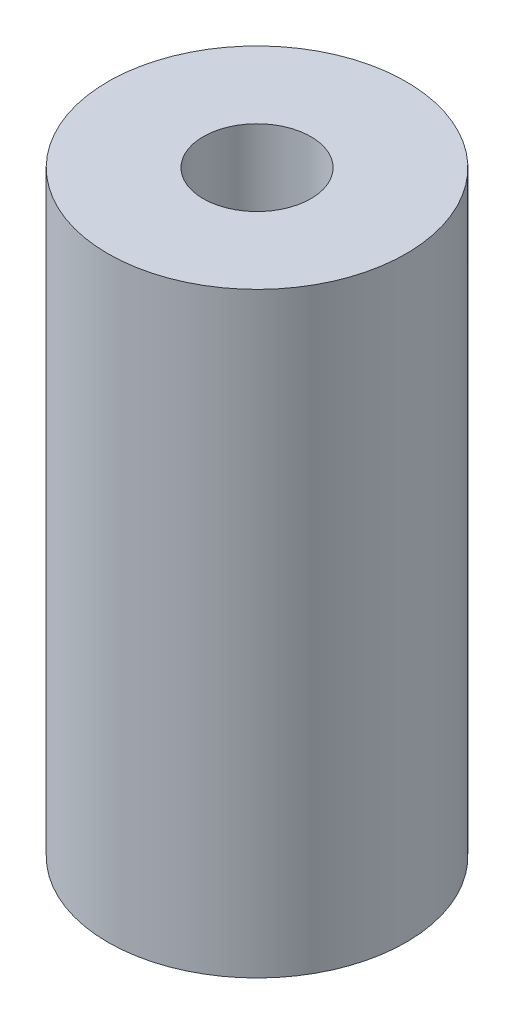
ISO-10303-21;
HEADER;
FILE_DESCRIPTION(('STEP AP214'),'2;1');
FILE_NAME('part.step','',(''),(''),'','','');
FILE_SCHEMA(('AUTOMOTIVE_DESIGN { 1 0 10303 214 1 1 1 1 }'));
ENDSEC;
DATA;
#1=APPLICATION_CONTEXT('core data for automotive mechanical design processes');
#2=APPLICATION_PROTOCOL_DEFINITION('international standard','automotive_design',2000,#1);
#3=PRODUCT_CONTEXT('',#1,'mechanical');
#4=PRODUCT('Part','Part','',(#3));
#5=PRODUCT_RELATED_PRODUCT_CATEGORY('part','',(#4));
#6=PRODUCT_DEFINITION_FORMATION('','',#4);
#7=PRODUCT_DEFINITION_CONTEXT('part definition',#1,'design');
#8=PRODUCT_DEFINITION('design','',#6,#7);
#9=PRODUCT_DEFINITION_SHAPE('','',#8);
#10=(LENGTH_UNIT() NAMED_UNIT(*) SI_UNIT(.MILLI.,.METRE.));
#11=(NAMED_UNIT(*) PLANE_ANGLE_UNIT() SI_UNIT($,.RADIAN.));
#12=(NAMED_UNIT(*) SI_UNIT($,.STERADIAN.) SOLID_ANGLE_UNIT());
#13=UNCERTAINTY_MEASURE_WITH_UNIT(LENGTH_MEASURE(1.E-05),#10,'distance_accuracy_value','');
#14=(GEOMETRIC_REPRESENTATION_CONTEXT(3) GLOBAL_UNCERTAINTY_ASSIGNED_CONTEXT((#13)) GLOBAL_UNIT_ASSIGNED_CONTEXT((#10,
#11,#12)) REPRESENTATION_CONTEXT('',''));
#15=CARTESIAN_POINT('',(0.,0.,0.));
#16=DIRECTION('',(0.,0.,1.));
#17=DIRECTION('',(1.,0.,0.));
#18=AXIS2_PLACEMENT_3D('',#15,#16,#17);
#19=CARTESIAN_POINT('',(0.,9.525,0.));
#20=DIRECTION('',(0.,1.,0.));
#21=DIRECTION('',(0.,0.,1.));
#22=AXIS2_PLACEMENT_3D('',#19,#20,#21);
#23=PLANE('',#22);
#24=CARTESIAN_POINT('',(0.,9.525,0.));
#25=DIRECTION('',(0.,1.,0.));
#26=DIRECTION('',(0.,0.,1.));
#27=AXIS2_PLACEMENT_3D('',#24,#25,#26);
#28=CIRCLE('',#27,2.38125);
#29=CARTESIAN_POINT('',(0.,9.525,2.38125));
#30=VERTEX_POINT('',#29);
#31=EDGE_CURVE('E10',#30,#30,#28,.T.);
#32=ORIENTED_EDGE('',*,*,#31,.T.);
#33=EDGE_LOOP('',(#32));
#34=FACE_BOUND('',#33,.T.);
#35=CARTESIAN_POINT('',(0.,9.525,0.));
#36=DIRECTION('',(0.,1.,0.));
#37=DIRECTION('',(0.,0.,1.));
#38=AXIS2_PLACEMENT_3D('',#35,#36,#37);
#39=CIRCLE('',#38,0.859478873912305);
#40=CARTESIAN_POINT('',(0.,9.525,0.859478873912305));
#41=VERTEX_POINT('',#40);
#42=EDGE_CURVE('E40',#41,#41,#39,.T.);
#43=ORIENTED_EDGE('',*,*,#42,.F.);
#44=EDGE_LOOP('',(#43));
#45=FACE_BOUND('',#44,.T.);
#46=ADVANCED_FACE('F29',(#34,#45),#23,.T.);
#47=CARTESIAN_POINT('',(0.,0.,0.));
#48=DIRECTION('',(0.,1.,0.));
#49=DIRECTION('',(0.,0.,1.));
#50=AXIS2_PLACEMENT_3D('',#47,#48,#49);
#51=PLANE('',#50);
#52=CARTESIAN_POINT('',(0.,0.,0.));
#53=DIRECTION('',(0.,1.,0.));
#54=DIRECTION('',(0.,0.,1.));
#55=AXIS2_PLACEMENT_3D('',#52,#53,#54);
#56=CIRCLE('',#55,2.38125);
#57=CARTESIAN_POINT('',(0.,0.,2.38125));
#58=VERTEX_POINT('',#57);
#59=EDGE_CURVE('E33',#58,#58,#56,.T.);
#60=ORIENTED_EDGE('',*,*,#59,.F.);
#61=EDGE_LOOP('',(#60));
#62=FACE_BOUND('',#61,.T.);
#63=CARTESIAN_POINT('',(0.,0.,0.));
#64=DIRECTION('',(0.,1.,0.));
#65=DIRECTION('',(0.,0.,1.));
#66=AXIS2_PLACEMENT_3D('',#63,#64,#65);
#67=CIRCLE('',#66,0.859478873912305);
#68=CARTESIAN_POINT('',(0.,0.,0.859478873912305));
#69=VERTEX_POINT('',#68);
#70=EDGE_CURVE('E42',#69,#69,#67,.T.);
#71=ORIENTED_EDGE('',*,*,#70,.T.);
#72=EDGE_LOOP('',(#71));
#73=FACE_BOUND('',#72,.T.);
#74=ADVANCED_FACE('F52',(#62,#73),#51,.F.);
#75=CARTESIAN_POINT('',(0.,9.525,0.));
#76=DIRECTION('',(0.,-1.,0.));
#77=DIRECTION('',(0.,0.,-1.));
#78=AXIS2_PLACEMENT_3D('',#75,#76,#77);
#79=CYLINDRICAL_SURFACE('',#78,2.38125);
#80=ORIENTED_EDGE('',*,*,#31,.F.);
#81=EDGE_LOOP('',(#80));
#82=FACE_BOUND('',#81,.T.);
#83=ORIENTED_EDGE('',*,*,#59,.T.);
#84=EDGE_LOOP('',(#83));
#85=FACE_BOUND('',#84,.T.);
#86=ADVANCED_FACE('F31',(#82,#85),#79,.T.);
#87=CARTESIAN_POINT('',(0.,9.525,0.));
#88=DIRECTION('',(0.,-1.,0.));
#89=DIRECTION('',(0.,0.,-1.));
#90=AXIS2_PLACEMENT_3D('',#87,#88,#89);
#91=CYLINDRICAL_SURFACE('',#90,0.859478873912305);
#92=ORIENTED_EDGE('',*,*,#42,.T.);
#93=EDGE_LOOP('',(#92));
#94=FACE_BOUND('',#93,.T.);
#95=ORIENTED_EDGE('',*,*,#70,.F.);
#96=EDGE_LOOP('',(#95));
#97=FACE_BOUND('',#96,.T.);
#98=ADVANCED_FACE('F48',(#94,#97),#91,.F.);
#99=CLOSED_SHELL('',(#46,#74,#86,#98));
#100=MANIFOLD_SOLID_BREP('B2',#99);
#101=ADVANCED_BREP_SHAPE_REPRESENTATION('',(#18,#100),#14);
#102=SHAPE_DEFINITION_REPRESENTATION(#9,#101);
ENDSEC;
END-ISO-10303-21;
